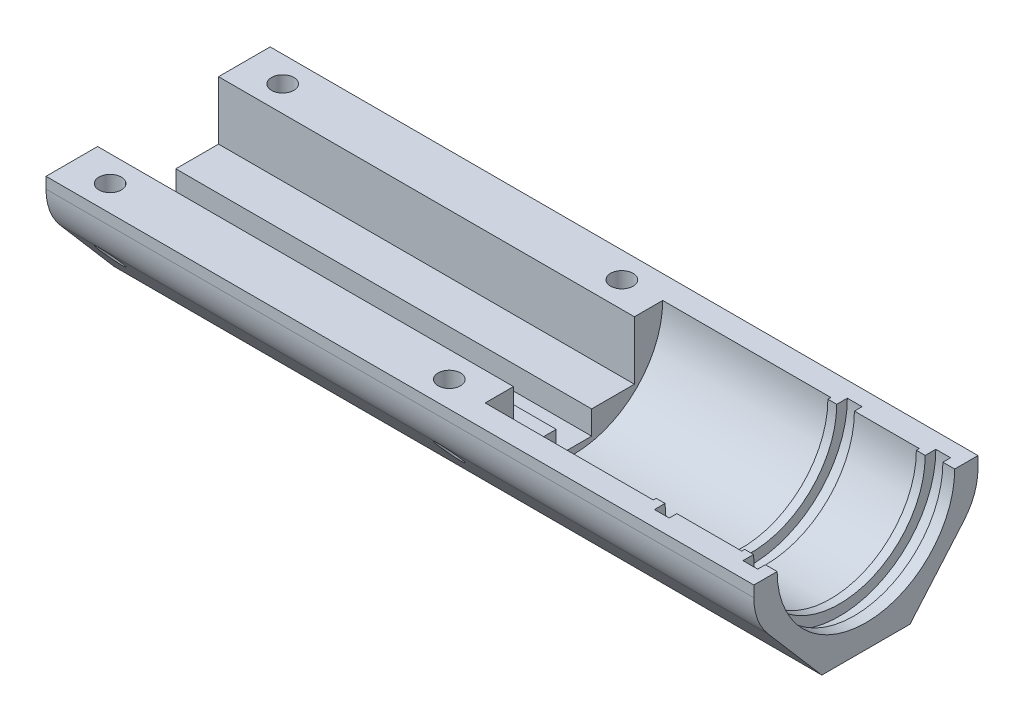
ISO-10303-21;
HEADER;
FILE_DESCRIPTION(('STEP AP214'),'2;1');
FILE_NAME('part.step','',(''),(''),'','','');
FILE_SCHEMA(('AUTOMOTIVE_DESIGN { 1 0 10303 214 1 1 1 1 }'));
ENDSEC;
DATA;
#1=APPLICATION_CONTEXT('core data for automotive mechanical design processes');
#2=APPLICATION_PROTOCOL_DEFINITION('international standard','automotive_design',2000,#1);
#3=PRODUCT_CONTEXT('',#1,'mechanical');
#4=PRODUCT('Part','Part','',(#3));
#5=PRODUCT_RELATED_PRODUCT_CATEGORY('part','',(#4));
#6=PRODUCT_DEFINITION_FORMATION('','',#4);
#7=PRODUCT_DEFINITION_CONTEXT('part definition',#1,'design');
#8=PRODUCT_DEFINITION('design','',#6,#7);
#9=PRODUCT_DEFINITION_SHAPE('','',#8);
#10=(LENGTH_UNIT() NAMED_UNIT(*) SI_UNIT(.MILLI.,.METRE.));
#11=(NAMED_UNIT(*) PLANE_ANGLE_UNIT() SI_UNIT($,.RADIAN.));
#12=(NAMED_UNIT(*) SI_UNIT($,.STERADIAN.) SOLID_ANGLE_UNIT());
#13=UNCERTAINTY_MEASURE_WITH_UNIT(LENGTH_MEASURE(1.E-05),#10,'distance_accuracy_value','');
#14=(GEOMETRIC_REPRESENTATION_CONTEXT(3) GLOBAL_UNCERTAINTY_ASSIGNED_CONTEXT((#13)) GLOBAL_UNIT_ASSIGNED_CONTEXT((#10,
#11,#12)) REPRESENTATION_CONTEXT('',''));
#15=CARTESIAN_POINT('',(0.,0.,0.));
#16=DIRECTION('',(0.,0.,1.));
#17=DIRECTION('',(1.,0.,0.));
#18=AXIS2_PLACEMENT_3D('',#15,#16,#17);
#19=CARTESIAN_POINT('',(0.,0.,-15.05));
#20=DIRECTION('',(-1.,0.,0.));
#21=DIRECTION('',(0.,0.,1.));
#22=AXIS2_PLACEMENT_3D('',#19,#20,#21);
#23=PLANE('',#22);
#24=DIRECTION('',(0.,1.,0.));
#25=VECTOR('',#24,1.);
#26=CARTESIAN_POINT('',(0.,0.,10.25));
#27=LINE('',#26,#25);
#28=CARTESIAN_POINT('',(0.,-9.90000000000001,10.25));
#29=VERTEX_POINT('',#28);
#30=CARTESIAN_POINT('',(0.,0.,10.25));
#31=VERTEX_POINT('',#30);
#32=EDGE_CURVE('E50',#29,#31,#27,.T.);
#33=ORIENTED_EDGE('',*,*,#32,.F.);
#34=DIRECTION('',(0.,0.,1.));
#35=VECTOR('',#34,1.);
#36=CARTESIAN_POINT('',(0.,-9.90000000000001,10.25));
#37=LINE('',#36,#35);
#38=CARTESIAN_POINT('',(0.,-9.89999999999999,3.));
#39=VERTEX_POINT('',#38);
#40=EDGE_CURVE('E390',#39,#29,#37,.T.);
#41=ORIENTED_EDGE('',*,*,#40,.F.);
#42=DIRECTION('',(0.,1.,0.));
#43=VECTOR('',#42,1.);
#44=CARTESIAN_POINT('',(0.,-9.89999999999999,3.));
#45=LINE('',#44,#43);
#46=CARTESIAN_POINT('',(0.,-13.9,3.));
#47=VERTEX_POINT('',#46);
#48=EDGE_CURVE('E387',#47,#39,#45,.T.);
#49=ORIENTED_EDGE('',*,*,#48,.F.);
#50=DIRECTION('',(0.,0.,1.));
#51=VECTOR('',#50,1.);
#52=CARTESIAN_POINT('',(0.,-13.9,-3.));
#53=LINE('',#52,#51);
#54=CARTESIAN_POINT('',(0.,-13.9,-3.));
#55=VERTEX_POINT('',#54);
#56=EDGE_CURVE('E384',#55,#47,#53,.T.);
#57=ORIENTED_EDGE('',*,*,#56,.F.);
#58=DIRECTION('',(0.,-1.,0.));
#59=VECTOR('',#58,1.);
#60=CARTESIAN_POINT('',(0.,-9.9,-2.99999999999999));
#61=LINE('',#60,#59);
#62=CARTESIAN_POINT('',(0.,-9.9,-2.99999999999999));
#63=VERTEX_POINT('',#62);
#64=EDGE_CURVE('E381',#63,#55,#61,.T.);
#65=ORIENTED_EDGE('',*,*,#64,.F.);
#66=DIRECTION('',(0.,0.,1.));
#67=VECTOR('',#66,1.);
#68=CARTESIAN_POINT('',(0.,-9.9,-2.99999999999999));
#69=LINE('',#68,#67);
#70=CARTESIAN_POINT('',(0.,-9.90000000000001,-10.25));
#71=VERTEX_POINT('',#70);
#72=EDGE_CURVE('E252',#71,#63,#69,.T.);
#73=ORIENTED_EDGE('',*,*,#72,.F.);
#74=DIRECTION('',(0.,-1.,0.));
#75=VECTOR('',#74,1.);
#76=CARTESIAN_POINT('',(0.,0.,-10.25));
#77=LINE('',#76,#75);
#78=CARTESIAN_POINT('',(0.,0.,-10.25));
#79=VERTEX_POINT('',#78);
#80=EDGE_CURVE('E236',#79,#71,#77,.T.);
#81=ORIENTED_EDGE('',*,*,#80,.F.);
#82=DIRECTION('',(0.,0.,-1.));
#83=VECTOR('',#82,1.);
#84=CARTESIAN_POINT('',(0.,0.,-15.05));
#85=LINE('',#84,#83);
#86=CARTESIAN_POINT('',(0.,0.,-19.));
#87=VERTEX_POINT('',#86);
#88=EDGE_CURVE('E248',#79,#87,#85,.T.);
#89=ORIENTED_EDGE('',*,*,#88,.T.);
#90=DIRECTION('',(0.,1.,0.));
#91=VECTOR('',#90,1.);
#92=CARTESIAN_POINT('',(0.,0.,-19.));
#93=LINE('',#92,#91);
#94=CARTESIAN_POINT('',(0.,-1.87765266245654,-19.));
#95=VERTEX_POINT('',#94);
#96=EDGE_CURVE('E430',#95,#87,#93,.T.);
#97=ORIENTED_EDGE('',*,*,#96,.F.);
#98=CARTESIAN_POINT('',(0.,-1.87765266245654,-9.));
#99=DIRECTION('',(-1.,0.,0.));
#100=DIRECTION('',(0.,0.,1.));
#101=AXIS2_PLACEMENT_3D('',#98,#99,#100);
#102=CIRCLE('',#101,10.);
#103=CARTESIAN_POINT('',(0.,-8.39458052178645,-16.5848303393214));
#104=VERTEX_POINT('',#103);
#105=EDGE_CURVE('E340',#95,#104,#102,.T.);
#106=ORIENTED_EDGE('',*,*,#105,.T.);
#107=DIRECTION('',(0.,-0.758483033932136,0.651692785932991));
#108=VECTOR('',#107,1.);
#109=CARTESIAN_POINT('',(0.,-4.32387106802505,-20.0824062453935));
#110=LINE('',#109,#108);
#111=CARTESIAN_POINT('',(0.,-19.0000000000001,-7.47259571237857));
#112=VERTEX_POINT('',#111);
#113=EDGE_CURVE('E422',#104,#112,#110,.T.);
#114=ORIENTED_EDGE('',*,*,#113,.T.);
#115=DIRECTION('',(0.,0.,1.));
#116=VECTOR('',#115,1.);
#117=CARTESIAN_POINT('',(0.,-18.9999999999999,25.0500000000001));
#118=LINE('',#117,#116);
#119=CARTESIAN_POINT('',(0.,-19.,7.4725957123786));
#120=VERTEX_POINT('',#119);
#121=EDGE_CURVE('E432',#112,#120,#118,.T.);
#122=ORIENTED_EDGE('',*,*,#121,.T.);
#123=DIRECTION('',(0.,0.758483033932136,0.651692785932991));
#124=VECTOR('',#123,1.);
#125=CARTESIAN_POINT('',(0.,-19.2022385041559,7.2988312795567));
#126=LINE('',#125,#124);
#127=CARTESIAN_POINT('',(0.,-8.39458052178646,16.5848303393214));
#128=VERTEX_POINT('',#127);
#129=EDGE_CURVE('E410',#120,#128,#126,.T.);
#130=ORIENTED_EDGE('',*,*,#129,.T.);
#131=CARTESIAN_POINT('',(0.,-1.87765266245654,9.));
#132=DIRECTION('',(-1.,0.,0.));
#133=DIRECTION('',(0.,0.,1.));
#134=AXIS2_PLACEMENT_3D('',#131,#132,#133);
#135=CIRCLE('',#134,10.);
#136=CARTESIAN_POINT('',(0.,-1.87765266245654,19.));
#137=VERTEX_POINT('',#136);
#138=EDGE_CURVE('E58',#128,#137,#135,.T.);
#139=ORIENTED_EDGE('',*,*,#138,.T.);
#140=DIRECTION('',(0.,-1.,0.));
#141=VECTOR('',#140,1.);
#142=CARTESIAN_POINT('',(0.,0.,19.));
#143=LINE('',#142,#141);
#144=CARTESIAN_POINT('',(0.,0.,19.));
#145=VERTEX_POINT('',#144);
#146=EDGE_CURVE('E417',#145,#137,#143,.T.);
#147=ORIENTED_EDGE('',*,*,#146,.F.);
#148=DIRECTION('',(0.,0.,1.));
#149=VECTOR('',#148,1.);
#150=CARTESIAN_POINT('',(0.,0.,15.05));
#151=LINE('',#150,#149);
#152=EDGE_CURVE('E447',#31,#145,#151,.T.);
#153=ORIENTED_EDGE('',*,*,#152,.F.);
#154=EDGE_LOOP('',(#33,#41,#49,#57,#65,#73,#81,#89,#97,#106,#114,#122,#130,#139,#147,#153));
#155=FACE_BOUND('',#154,.T.);
#156=ADVANCED_FACE('F33',(#155),#23,.T.);
#157=CARTESIAN_POINT('',(120.,0.,-15.05));
#158=DIRECTION('',(1.,0.,0.));
#159=DIRECTION('',(0.,0.,-1.));
#160=AXIS2_PLACEMENT_3D('',#157,#158,#159);
#161=PLANE('',#160);
#162=DIRECTION('',(0.,0.758483033932136,-0.651692785932991));
#163=VECTOR('',#162,1.);
#164=CARTESIAN_POINT('',(120.,-4.32387106802505,-20.0824062453935));
#165=LINE('',#164,#163);
#166=CARTESIAN_POINT('',(120.,-19.0000000000001,-7.47259571237857));
#167=VERTEX_POINT('',#166);
#168=CARTESIAN_POINT('',(120.,-8.39458052178645,-16.5848303393214));
#169=VERTEX_POINT('',#168);
#170=EDGE_CURVE('E419',#167,#169,#165,.T.);
#171=ORIENTED_EDGE('',*,*,#170,.T.);
#172=CARTESIAN_POINT('',(120.,-1.87765266245654,-9.));
#173=DIRECTION('',(1.,0.,0.));
#174=DIRECTION('',(0.,0.,-1.));
#175=AXIS2_PLACEMENT_3D('',#172,#173,#174);
#176=CIRCLE('',#175,10.);
#177=CARTESIAN_POINT('',(120.,-1.87765266245654,-19.));
#178=VERTEX_POINT('',#177);
#179=EDGE_CURVE('E335',#169,#178,#176,.T.);
#180=ORIENTED_EDGE('',*,*,#179,.T.);
#181=DIRECTION('',(0.,-1.,0.));
#182=VECTOR('',#181,1.);
#183=CARTESIAN_POINT('',(120.,0.,-19.));
#184=LINE('',#183,#182);
#185=CARTESIAN_POINT('',(120.,0.,-19.));
#186=VERTEX_POINT('',#185);
#187=EDGE_CURVE('E427',#186,#178,#184,.T.);
#188=ORIENTED_EDGE('',*,*,#187,.F.);
#189=DIRECTION('',(0.,0.,1.));
#190=VECTOR('',#189,1.);
#191=CARTESIAN_POINT('',(120.,0.,-15.05));
#192=LINE('',#191,#190);
#193=CARTESIAN_POINT('',(120.,0.,-15.05));
#194=VERTEX_POINT('',#193);
#195=EDGE_CURVE('E258',#186,#194,#192,.T.);
#196=ORIENTED_EDGE('',*,*,#195,.T.);
#197=CARTESIAN_POINT('',(120.,0.,0.));
#198=DIRECTION('',(-1.,0.,0.));
#199=DIRECTION('',(0.,0.,1.));
#200=AXIS2_PLACEMENT_3D('',#197,#198,#199);
#201=CIRCLE('',#200,15.05);
#202=CARTESIAN_POINT('',(120.,0.,15.05));
#203=VERTEX_POINT('',#202);
#204=EDGE_CURVE('E311',#194,#203,#201,.T.);
#205=ORIENTED_EDGE('',*,*,#204,.T.);
#206=DIRECTION('',(0.,0.,-1.));
#207=VECTOR('',#206,1.);
#208=CARTESIAN_POINT('',(120.,0.,15.05));
#209=LINE('',#208,#207);
#210=CARTESIAN_POINT('',(120.,0.,19.));
#211=VERTEX_POINT('',#210);
#212=EDGE_CURVE('E449',#211,#203,#209,.T.);
#213=ORIENTED_EDGE('',*,*,#212,.F.);
#214=DIRECTION('',(0.,1.,0.));
#215=VECTOR('',#214,1.);
#216=CARTESIAN_POINT('',(120.,0.,19.));
#217=LINE('',#216,#215);
#218=CARTESIAN_POINT('',(120.,-1.87765266245654,19.));
#219=VERTEX_POINT('',#218);
#220=EDGE_CURVE('E415',#219,#211,#217,.T.);
#221=ORIENTED_EDGE('',*,*,#220,.F.);
#222=CARTESIAN_POINT('',(120.,-1.87765266245654,9.));
#223=DIRECTION('',(1.,0.,0.));
#224=DIRECTION('',(0.,0.,-1.));
#225=AXIS2_PLACEMENT_3D('',#222,#223,#224);
#226=CIRCLE('',#225,10.);
#227=CARTESIAN_POINT('',(120.,-8.39458052178645,16.5848303393214));
#228=VERTEX_POINT('',#227);
#229=EDGE_CURVE('E333',#219,#228,#226,.T.);
#230=ORIENTED_EDGE('',*,*,#229,.T.);
#231=DIRECTION('',(0.,-0.758483033932136,-0.651692785932991));
#232=VECTOR('',#231,1.);
#233=CARTESIAN_POINT('',(120.,-19.2022385041559,7.2988312795567));
#234=LINE('',#233,#232);
#235=CARTESIAN_POINT('',(120.,-19.,7.4725957123786));
#236=VERTEX_POINT('',#235);
#237=EDGE_CURVE('E408',#228,#236,#234,.T.);
#238=ORIENTED_EDGE('',*,*,#237,.T.);
#239=DIRECTION('',(0.,0.,1.));
#240=VECTOR('',#239,1.);
#241=CARTESIAN_POINT('',(120.,-19.0000000000001,-15.0499999999999));
#242=LINE('',#241,#240);
#243=EDGE_CURVE('E323',#167,#236,#242,.T.);
#244=ORIENTED_EDGE('',*,*,#243,.F.);
#245=EDGE_LOOP('',(#171,#180,#188,#196,#205,#213,#221,#230,#238,#244));
#246=FACE_BOUND('',#245,.T.);
#247=ADVANCED_FACE('F553',(#246),#161,.T.);
#248=CARTESIAN_POINT('',(0.,-19.,0.));
#249=DIRECTION('',(0.,1.,0.));
#250=DIRECTION('',(0.,0.,1.));
#251=AXIS2_PLACEMENT_3D('',#248,#249,#250);
#252=PLANE('',#251);
#253=DIRECTION('',(1.,0.,0.));
#254=VECTOR('',#253,1.);
#255=CARTESIAN_POINT('',(0.,-19.,7.47259571237864));
#256=LINE('',#255,#254);
#257=EDGE_CURVE('E412',#120,#236,#256,.T.);
#258=ORIENTED_EDGE('',*,*,#257,.F.);
#259=ORIENTED_EDGE('',*,*,#121,.F.);
#260=DIRECTION('',(-1.,0.,0.));
#261=VECTOR('',#260,1.);
#262=CARTESIAN_POINT('',(0.,-19.,-7.4725957123786));
#263=LINE('',#262,#261);
#264=EDGE_CURVE('E424',#167,#112,#263,.T.);
#265=ORIENTED_EDGE('',*,*,#264,.F.);
#266=ORIENTED_EDGE('',*,*,#243,.T.);
#267=EDGE_LOOP('',(#258,#259,#265,#266));
#268=FACE_BOUND('',#267,.T.);
#269=ADVANCED_FACE('F571',(#268),#252,.F.);
#270=CARTESIAN_POINT('',(0.,0.,19.));
#271=DIRECTION('',(0.,0.,-1.));
#272=DIRECTION('',(1.,0.,0.));
#273=AXIS2_PLACEMENT_3D('',#270,#271,#272);
#274=PLANE('',#273);
#275=ORIENTED_EDGE('',*,*,#146,.T.);
#276=DIRECTION('',(-1.,0.,0.));
#277=VECTOR('',#276,1.);
#278=CARTESIAN_POINT('',(120.,-1.87765266245654,19.));
#279=LINE('',#278,#277);
#280=EDGE_CURVE('E345',#137,#219,#279,.F.);
#281=ORIENTED_EDGE('',*,*,#280,.T.);
#282=ORIENTED_EDGE('',*,*,#220,.T.);
#283=DIRECTION('',(-1.,0.,0.));
#284=VECTOR('',#283,1.);
#285=CARTESIAN_POINT('',(0.,0.,19.));
#286=LINE('',#285,#284);
#287=EDGE_CURVE('E327',#211,#145,#286,.T.);
#288=ORIENTED_EDGE('',*,*,#287,.T.);
#289=EDGE_LOOP('',(#275,#281,#282,#288));
#290=FACE_BOUND('',#289,.T.);
#291=ADVANCED_FACE('F580',(#290),#274,.F.);
#292=CARTESIAN_POINT('',(0.,0.,-19.));
#293=DIRECTION('',(0.,0.,1.));
#294=DIRECTION('',(1.,0.,0.));
#295=AXIS2_PLACEMENT_3D('',#292,#293,#294);
#296=PLANE('',#295);
#297=ORIENTED_EDGE('',*,*,#187,.T.);
#298=DIRECTION('',(1.,0.,0.));
#299=VECTOR('',#298,1.);
#300=CARTESIAN_POINT('',(0.,-1.87765266245654,-19.));
#301=LINE('',#300,#299);
#302=EDGE_CURVE('E337',#178,#95,#301,.F.);
#303=ORIENTED_EDGE('',*,*,#302,.T.);
#304=ORIENTED_EDGE('',*,*,#96,.T.);
#305=DIRECTION('',(-1.,0.,0.));
#306=VECTOR('',#305,1.);
#307=CARTESIAN_POINT('',(0.,0.,-19.));
#308=LINE('',#307,#306);
#309=EDGE_CURVE('E257',#186,#87,#308,.T.);
#310=ORIENTED_EDGE('',*,*,#309,.F.);
#311=EDGE_LOOP('',(#297,#303,#304,#310));
#312=FACE_BOUND('',#311,.T.);
#313=ADVANCED_FACE('F558',(#312),#296,.F.);
#314=CARTESIAN_POINT('',(0.,0.,0.));
#315=DIRECTION('',(-1.,0.,0.));
#316=DIRECTION('',(0.,0.,1.));
#317=AXIS2_PLACEMENT_3D('',#314,#315,#316);
#318=CYLINDRICAL_SURFACE('',#317,14.55);
#319=CARTESIAN_POINT('',(99.,0.,0.));
#320=DIRECTION('',(-1.,0.,0.));
#321=DIRECTION('',(0.,0.,1.));
#322=AXIS2_PLACEMENT_3D('',#319,#320,#321);
#323=CIRCLE('',#322,14.55);
#324=CARTESIAN_POINT('',(99.,0.,-14.55));
#325=VERTEX_POINT('',#324);
#326=CARTESIAN_POINT('',(99.,0.,14.55));
#327=VERTEX_POINT('',#326);
#328=EDGE_CURVE('E318',#325,#327,#323,.T.);
#329=ORIENTED_EDGE('',*,*,#328,.T.);
#330=DIRECTION('',(-1.,0.,0.));
#331=VECTOR('',#330,1.);
#332=CARTESIAN_POINT('',(100.5,0.,14.55));
#333=LINE('',#332,#331);
#334=CARTESIAN_POINT('',(100.5,0.,14.55));
#335=VERTEX_POINT('',#334);
#336=EDGE_CURVE('E435',#335,#327,#333,.T.);
#337=ORIENTED_EDGE('',*,*,#336,.F.);
#338=CARTESIAN_POINT('',(100.5,0.,0.));
#339=DIRECTION('',(-1.,0.,0.));
#340=DIRECTION('',(0.,0.,1.));
#341=AXIS2_PLACEMENT_3D('',#338,#339,#340);
#342=CIRCLE('',#341,14.55);
#343=CARTESIAN_POINT('',(100.5,0.,-14.55));
#344=VERTEX_POINT('',#343);
#345=EDGE_CURVE('E320',#344,#335,#342,.T.);
#346=ORIENTED_EDGE('',*,*,#345,.F.);
#347=DIRECTION('',(-1.,0.,0.));
#348=VECTOR('',#347,1.);
#349=CARTESIAN_POINT('',(100.5,0.,-14.55));
#350=LINE('',#349,#348);
#351=EDGE_CURVE('E482',#344,#325,#350,.T.);
#352=ORIENTED_EDGE('',*,*,#351,.T.);
#353=EDGE_LOOP('',(#329,#337,#346,#352));
#354=FACE_BOUND('',#353,.T.);
#355=ADVANCED_FACE('F510',(#354),#318,.F.);
#356=CARTESIAN_POINT('',(99.,0.,-15.05));
#357=DIRECTION('',(-1.,0.,0.));
#358=DIRECTION('',(0.,0.,1.));
#359=AXIS2_PLACEMENT_3D('',#356,#357,#358);
#360=PLANE('',#359);
#361=CARTESIAN_POINT('',(99.,0.,0.));
#362=DIRECTION('',(-1.,0.,0.));
#363=DIRECTION('',(0.,0.,1.));
#364=AXIS2_PLACEMENT_3D('',#361,#362,#363);
#365=CIRCLE('',#364,15.05);
#366=CARTESIAN_POINT('',(99.,0.,-15.05));
#367=VERTEX_POINT('',#366);
#368=CARTESIAN_POINT('',(99.,0.,15.05));
#369=VERTEX_POINT('',#368);
#370=EDGE_CURVE('E316',#367,#369,#365,.T.);
#371=ORIENTED_EDGE('',*,*,#370,.T.);
#372=DIRECTION('',(0.,0.,1.));
#373=VECTOR('',#372,1.);
#374=CARTESIAN_POINT('',(99.,0.,15.05));
#375=LINE('',#374,#373);
#376=EDGE_CURVE('E438',#327,#369,#375,.T.);
#377=ORIENTED_EDGE('',*,*,#376,.F.);
#378=ORIENTED_EDGE('',*,*,#328,.F.);
#379=DIRECTION('',(0.,0.,-1.));
#380=VECTOR('',#379,1.);
#381=CARTESIAN_POINT('',(99.,0.,-15.05));
#382=LINE('',#381,#380);
#383=EDGE_CURVE('E485',#325,#367,#382,.T.);
#384=ORIENTED_EDGE('',*,*,#383,.T.);
#385=EDGE_LOOP('',(#371,#377,#378,#384));
#386=FACE_BOUND('',#385,.T.);
#387=ADVANCED_FACE('F505',(#386),#360,.T.);
#388=CARTESIAN_POINT('',(0.,0.,0.));
#389=DIRECTION('',(-1.,0.,0.));
#390=DIRECTION('',(0.,0.,1.));
#391=AXIS2_PLACEMENT_3D('',#388,#389,#390);
#392=CYLINDRICAL_SURFACE('',#391,15.05);
#393=CARTESIAN_POINT('',(70.5,0.,0.));
#394=DIRECTION('',(-1.,0.,0.));
#395=DIRECTION('',(0.,0.,1.));
#396=AXIS2_PLACEMENT_3D('',#393,#394,#395);
#397=CIRCLE('',#396,15.05);
#398=CARTESIAN_POINT('',(70.5,0.,-15.05));
#399=VERTEX_POINT('',#398);
#400=CARTESIAN_POINT('',(70.5,0.,15.05));
#401=VERTEX_POINT('',#400);
#402=EDGE_CURVE('E314',#399,#401,#397,.T.);
#403=ORIENTED_EDGE('',*,*,#402,.T.);
#404=DIRECTION('',(-1.,0.,0.));
#405=VECTOR('',#404,1.);
#406=CARTESIAN_POINT('',(70.5,0.,15.05));
#407=LINE('',#406,#405);
#408=EDGE_CURVE('E441',#369,#401,#407,.T.);
#409=ORIENTED_EDGE('',*,*,#408,.F.);
#410=ORIENTED_EDGE('',*,*,#370,.F.);
#411=DIRECTION('',(-1.,0.,0.));
#412=VECTOR('',#411,1.);
#413=CARTESIAN_POINT('',(70.5,0.,-15.05));
#414=LINE('',#413,#412);
#415=EDGE_CURVE('E263',#367,#399,#414,.T.);
#416=ORIENTED_EDGE('',*,*,#415,.T.);
#417=EDGE_LOOP('',(#403,#409,#410,#416));
#418=FACE_BOUND('',#417,.T.);
#419=ADVANCED_FACE('F490',(#418),#392,.F.);
#420=CARTESIAN_POINT('',(70.5,0.,-15.05));
#421=DIRECTION('',(1.,0.,0.));
#422=DIRECTION('',(0.,0.,-1.));
#423=AXIS2_PLACEMENT_3D('',#420,#421,#422);
#424=PLANE('',#423);
#425=DIRECTION('',(0.,-1.,0.));
#426=VECTOR('',#425,1.);
#427=CARTESIAN_POINT('',(70.5,0.,10.25));
#428=LINE('',#427,#426);
#429=CARTESIAN_POINT('',(70.5,0.,10.25));
#430=VERTEX_POINT('',#429);
#431=CARTESIAN_POINT('',(70.5,-9.90000000000001,10.25));
#432=VERTEX_POINT('',#431);
#433=EDGE_CURVE('E396',#430,#432,#428,.T.);
#434=ORIENTED_EDGE('',*,*,#433,.F.);
#435=DIRECTION('',(0.,0.,-1.));
#436=VECTOR('',#435,1.);
#437=CARTESIAN_POINT('',(70.5,0.,15.05));
#438=LINE('',#437,#436);
#439=EDGE_CURVE('E444',#401,#430,#438,.T.);
#440=ORIENTED_EDGE('',*,*,#439,.F.);
#441=ORIENTED_EDGE('',*,*,#402,.F.);
#442=DIRECTION('',(0.,0.,1.));
#443=VECTOR('',#442,1.);
#444=CARTESIAN_POINT('',(70.5,0.,-15.05));
#445=LINE('',#444,#443);
#446=CARTESIAN_POINT('',(70.5,0.,-10.25));
#447=VERTEX_POINT('',#446);
#448=EDGE_CURVE('E259',#399,#447,#445,.T.);
#449=ORIENTED_EDGE('',*,*,#448,.T.);
#450=DIRECTION('',(0.,1.,0.));
#451=VECTOR('',#450,1.);
#452=CARTESIAN_POINT('',(70.5,0.,-10.25));
#453=LINE('',#452,#451);
#454=CARTESIAN_POINT('',(70.5,-9.90000000000001,-10.25));
#455=VERTEX_POINT('',#454);
#456=EDGE_CURVE('E239',#455,#447,#453,.T.);
#457=ORIENTED_EDGE('',*,*,#456,.F.);
#458=DIRECTION('',(0.,0.,-1.));
#459=VECTOR('',#458,1.);
#460=CARTESIAN_POINT('',(70.5,-9.90000000000001,-15.05));
#461=LINE('',#460,#459);
#462=CARTESIAN_POINT('',(70.5,-9.9,-2.99999999999999));
#463=VERTEX_POINT('',#462);
#464=EDGE_CURVE('E244',#463,#455,#461,.T.);
#465=ORIENTED_EDGE('',*,*,#464,.F.);
#466=DIRECTION('',(0.,1.,0.));
#467=VECTOR('',#466,1.);
#468=CARTESIAN_POINT('',(70.5,0.,-2.99999999999996));
#469=LINE('',#468,#467);
#470=CARTESIAN_POINT('',(70.5,-13.9,-3.));
#471=VERTEX_POINT('',#470);
#472=EDGE_CURVE('E349',#471,#463,#469,.T.);
#473=ORIENTED_EDGE('',*,*,#472,.F.);
#474=DIRECTION('',(0.,0.,-1.));
#475=VECTOR('',#474,1.);
#476=CARTESIAN_POINT('',(70.5,-13.9,-15.05));
#477=LINE('',#476,#475);
#478=CARTESIAN_POINT('',(70.5,-13.9,3.));
#479=VERTEX_POINT('',#478);
#480=EDGE_CURVE('E351',#479,#471,#477,.T.);
#481=ORIENTED_EDGE('',*,*,#480,.F.);
#482=DIRECTION('',(0.,-1.,0.));
#483=VECTOR('',#482,1.);
#484=CARTESIAN_POINT('',(70.5,0.,3.));
#485=LINE('',#484,#483);
#486=CARTESIAN_POINT('',(70.5,-9.89999999999999,3.));
#487=VERTEX_POINT('',#486);
#488=EDGE_CURVE('E42',#487,#479,#485,.T.);
#489=ORIENTED_EDGE('',*,*,#488,.F.);
#490=DIRECTION('',(0.,0.,-1.));
#491=VECTOR('',#490,1.);
#492=CARTESIAN_POINT('',(70.5,-9.89999999999994,-15.05));
#493=LINE('',#492,#491);
#494=EDGE_CURVE('E11',#432,#487,#493,.T.);
#495=ORIENTED_EDGE('',*,*,#494,.F.);
#496=EDGE_LOOP('',(#434,#440,#441,#449,#457,#465,#473,#481,#489,#495));
#497=FACE_BOUND('',#496,.T.);
#498=ADVANCED_FACE('F495',(#497),#424,.T.);
#499=CARTESIAN_POINT('',(0.,0.,0.));
#500=DIRECTION('',(-1.,0.,0.));
#501=DIRECTION('',(0.,0.,1.));
#502=AXIS2_PLACEMENT_3D('',#499,#500,#501);
#503=CYLINDRICAL_SURFACE('',#502,15.05);
#504=CARTESIAN_POINT('',(118.,0.,0.));
#505=DIRECTION('',(-1.,0.,0.));
#506=DIRECTION('',(0.,0.,1.));
#507=AXIS2_PLACEMENT_3D('',#504,#505,#506);
#508=CIRCLE('',#507,15.05);
#509=CARTESIAN_POINT('',(118.,0.,-15.05));
#510=VERTEX_POINT('',#509);
#511=CARTESIAN_POINT('',(118.,0.,15.05));
#512=VERTEX_POINT('',#511);
#513=EDGE_CURVE('E309',#510,#512,#508,.T.);
#514=ORIENTED_EDGE('',*,*,#513,.T.);
#515=DIRECTION('',(-1.,0.,0.));
#516=VECTOR('',#515,1.);
#517=CARTESIAN_POINT('',(118.,0.,15.05));
#518=LINE('',#517,#516);
#519=EDGE_CURVE('E451',#203,#512,#518,.T.);
#520=ORIENTED_EDGE('',*,*,#519,.F.);
#521=ORIENTED_EDGE('',*,*,#204,.F.);
#522=DIRECTION('',(-1.,0.,0.));
#523=VECTOR('',#522,1.);
#524=CARTESIAN_POINT('',(118.,0.,-15.05));
#525=LINE('',#524,#523);
#526=EDGE_CURVE('E261',#194,#510,#525,.T.);
#527=ORIENTED_EDGE('',*,*,#526,.T.);
#528=EDGE_LOOP('',(#514,#520,#521,#527));
#529=FACE_BOUND('',#528,.T.);
#530=ADVANCED_FACE('F550',(#529),#503,.F.);
#531=CARTESIAN_POINT('',(118.,0.,-15.05));
#532=DIRECTION('',(-1.,0.,0.));
#533=DIRECTION('',(0.,0.,1.));
#534=AXIS2_PLACEMENT_3D('',#531,#532,#533);
#535=PLANE('',#534);
#536=CARTESIAN_POINT('',(118.,0.,0.));
#537=DIRECTION('',(-1.,0.,0.));
#538=DIRECTION('',(0.,0.,1.));
#539=AXIS2_PLACEMENT_3D('',#536,#537,#538);
#540=CIRCLE('',#539,16.35);
#541=CARTESIAN_POINT('',(118.,0.,-16.35));
#542=VERTEX_POINT('',#541);
#543=CARTESIAN_POINT('',(118.,0.,16.35));
#544=VERTEX_POINT('',#543);
#545=EDGE_CURVE('E307',#542,#544,#540,.T.);
#546=ORIENTED_EDGE('',*,*,#545,.T.);
#547=DIRECTION('',(0.,0.,1.));
#548=VECTOR('',#547,1.);
#549=CARTESIAN_POINT('',(118.,0.,15.05));
#550=LINE('',#549,#548);
#551=EDGE_CURVE('E454',#512,#544,#550,.T.);
#552=ORIENTED_EDGE('',*,*,#551,.F.);
#553=ORIENTED_EDGE('',*,*,#513,.F.);
#554=DIRECTION('',(0.,0.,-1.));
#555=VECTOR('',#554,1.);
#556=CARTESIAN_POINT('',(118.,0.,-15.05));
#557=LINE('',#556,#555);
#558=EDGE_CURVE('E269',#510,#542,#557,.T.);
#559=ORIENTED_EDGE('',*,*,#558,.T.);
#560=EDGE_LOOP('',(#546,#552,#553,#559));
#561=FACE_BOUND('',#560,.T.);
#562=ADVANCED_FACE('F545',(#561),#535,.T.);
#563=CARTESIAN_POINT('',(0.,0.,0.));
#564=DIRECTION('',(-1.,0.,0.));
#565=DIRECTION('',(0.,0.,1.));
#566=AXIS2_PLACEMENT_3D('',#563,#564,#565);
#567=CYLINDRICAL_SURFACE('',#566,16.35);
#568=CARTESIAN_POINT('',(115.5,0.,0.));
#569=DIRECTION('',(-1.,0.,0.));
#570=DIRECTION('',(0.,0.,1.));
#571=AXIS2_PLACEMENT_3D('',#568,#569,#570);
#572=CIRCLE('',#571,16.35);
#573=CARTESIAN_POINT('',(115.5,0.,-16.35));
#574=VERTEX_POINT('',#573);
#575=CARTESIAN_POINT('',(115.5,0.,16.35));
#576=VERTEX_POINT('',#575);
#577=EDGE_CURVE('E305',#574,#576,#572,.T.);
#578=ORIENTED_EDGE('',*,*,#577,.T.);
#579=DIRECTION('',(-1.,0.,0.));
#580=VECTOR('',#579,1.);
#581=CARTESIAN_POINT('',(115.5,0.,16.35));
#582=LINE('',#581,#580);
#583=EDGE_CURVE('E457',#544,#576,#582,.T.);
#584=ORIENTED_EDGE('',*,*,#583,.F.);
#585=ORIENTED_EDGE('',*,*,#545,.F.);
#586=DIRECTION('',(-1.,0.,0.));
#587=VECTOR('',#586,1.);
#588=CARTESIAN_POINT('',(115.5,0.,-16.35));
#589=LINE('',#588,#587);
#590=EDGE_CURVE('E272',#542,#574,#589,.T.);
#591=ORIENTED_EDGE('',*,*,#590,.T.);
#592=EDGE_LOOP('',(#578,#584,#585,#591));
#593=FACE_BOUND('',#592,.T.);
#594=ADVANCED_FACE('F541',(#593),#567,.F.);
#595=CARTESIAN_POINT('',(115.5,0.,-15.05));
#596=DIRECTION('',(1.,0.,0.));
#597=DIRECTION('',(0.,0.,-1.));
#598=AXIS2_PLACEMENT_3D('',#595,#596,#597);
#599=PLANE('',#598);
#600=CARTESIAN_POINT('',(115.5,0.,0.));
#601=DIRECTION('',(-1.,0.,0.));
#602=DIRECTION('',(0.,0.,1.));
#603=AXIS2_PLACEMENT_3D('',#600,#601,#602);
#604=CIRCLE('',#603,14.55);
#605=CARTESIAN_POINT('',(115.5,0.,-14.55));
#606=VERTEX_POINT('',#605);
#607=CARTESIAN_POINT('',(115.5,0.,14.55));
#608=VERTEX_POINT('',#607);
#609=EDGE_CURVE('E302',#606,#608,#604,.T.);
#610=ORIENTED_EDGE('',*,*,#609,.T.);
#611=DIRECTION('',(0.,0.,-1.));
#612=VECTOR('',#611,1.);
#613=CARTESIAN_POINT('',(115.5,0.,15.05));
#614=LINE('',#613,#612);
#615=EDGE_CURVE('E460',#576,#608,#614,.T.);
#616=ORIENTED_EDGE('',*,*,#615,.F.);
#617=ORIENTED_EDGE('',*,*,#577,.F.);
#618=DIRECTION('',(0.,0.,1.));
#619=VECTOR('',#618,1.);
#620=CARTESIAN_POINT('',(115.5,0.,-15.05));
#621=LINE('',#620,#619);
#622=EDGE_CURVE('E275',#574,#606,#621,.T.);
#623=ORIENTED_EDGE('',*,*,#622,.T.);
#624=EDGE_LOOP('',(#610,#616,#617,#623));
#625=FACE_BOUND('',#624,.T.);
#626=ADVANCED_FACE('F538',(#625),#599,.T.);
#627=CARTESIAN_POINT('',(0.,0.,0.));
#628=DIRECTION('',(-1.,0.,0.));
#629=DIRECTION('',(0.,0.,1.));
#630=AXIS2_PLACEMENT_3D('',#627,#628,#629);
#631=CYLINDRICAL_SURFACE('',#630,14.55);
#632=CARTESIAN_POINT('',(114.,0.,0.));
#633=DIRECTION('',(-1.,0.,0.));
#634=DIRECTION('',(0.,0.,1.));
#635=AXIS2_PLACEMENT_3D('',#632,#633,#634);
#636=CIRCLE('',#635,14.55);
#637=CARTESIAN_POINT('',(114.,0.,-14.55));
#638=VERTEX_POINT('',#637);
#639=CARTESIAN_POINT('',(114.,0.,14.55));
#640=VERTEX_POINT('',#639);
#641=EDGE_CURVE('E300',#638,#640,#636,.T.);
#642=ORIENTED_EDGE('',*,*,#641,.T.);
#643=DIRECTION('',(-1.,0.,0.));
#644=VECTOR('',#643,1.);
#645=CARTESIAN_POINT('',(115.5,0.,14.55));
#646=LINE('',#645,#644);
#647=EDGE_CURVE('E462',#608,#640,#646,.T.);
#648=ORIENTED_EDGE('',*,*,#647,.F.);
#649=ORIENTED_EDGE('',*,*,#609,.F.);
#650=DIRECTION('',(-1.,0.,0.));
#651=VECTOR('',#650,1.);
#652=CARTESIAN_POINT('',(115.5,0.,-14.55));
#653=LINE('',#652,#651);
#654=EDGE_CURVE('E277',#606,#638,#653,.T.);
#655=ORIENTED_EDGE('',*,*,#654,.T.);
#656=EDGE_LOOP('',(#642,#648,#649,#655));
#657=FACE_BOUND('',#656,.T.);
#658=ADVANCED_FACE('F534',(#657),#631,.F.);
#659=CARTESIAN_POINT('',(114.,0.,-15.05));
#660=DIRECTION('',(-1.,0.,0.));
#661=DIRECTION('',(0.,0.,1.));
#662=AXIS2_PLACEMENT_3D('',#659,#660,#661);
#663=PLANE('',#662);
#664=CARTESIAN_POINT('',(114.,0.,0.));
#665=DIRECTION('',(-1.,0.,0.));
#666=DIRECTION('',(0.,0.,1.));
#667=AXIS2_PLACEMENT_3D('',#664,#665,#666);
#668=CIRCLE('',#667,15.05);
#669=CARTESIAN_POINT('',(114.,0.,-15.05));
#670=VERTEX_POINT('',#669);
#671=CARTESIAN_POINT('',(114.,0.,15.05));
#672=VERTEX_POINT('',#671);
#673=EDGE_CURVE('E298',#670,#672,#668,.T.);
#674=ORIENTED_EDGE('',*,*,#673,.T.);
#675=DIRECTION('',(0.,0.,1.));
#676=VECTOR('',#675,1.);
#677=CARTESIAN_POINT('',(114.,0.,15.05));
#678=LINE('',#677,#676);
#679=EDGE_CURVE('E465',#640,#672,#678,.T.);
#680=ORIENTED_EDGE('',*,*,#679,.F.);
#681=ORIENTED_EDGE('',*,*,#641,.F.);
#682=DIRECTION('',(0.,0.,-1.));
#683=VECTOR('',#682,1.);
#684=CARTESIAN_POINT('',(114.,0.,-15.05));
#685=LINE('',#684,#683);
#686=EDGE_CURVE('E280',#638,#670,#685,.T.);
#687=ORIENTED_EDGE('',*,*,#686,.T.);
#688=EDGE_LOOP('',(#674,#680,#681,#687));
#689=FACE_BOUND('',#688,.T.);
#690=ADVANCED_FACE('F528',(#689),#663,.T.);
#691=CARTESIAN_POINT('',(0.,0.,0.));
#692=DIRECTION('',(-1.,0.,0.));
#693=DIRECTION('',(0.,0.,1.));
#694=AXIS2_PLACEMENT_3D('',#691,#692,#693);
#695=CYLINDRICAL_SURFACE('',#694,15.05);
#696=CARTESIAN_POINT('',(103.,0.,0.));
#697=DIRECTION('',(-1.,0.,0.));
#698=DIRECTION('',(0.,0.,1.));
#699=AXIS2_PLACEMENT_3D('',#696,#697,#698);
#700=CIRCLE('',#699,15.05);
#701=CARTESIAN_POINT('',(103.,0.,-15.05));
#702=VERTEX_POINT('',#701);
#703=CARTESIAN_POINT('',(103.,0.,15.05));
#704=VERTEX_POINT('',#703);
#705=EDGE_CURVE('E296',#702,#704,#700,.T.);
#706=ORIENTED_EDGE('',*,*,#705,.T.);
#707=DIRECTION('',(-1.,0.,0.));
#708=VECTOR('',#707,1.);
#709=CARTESIAN_POINT('',(103.,0.,15.05));
#710=LINE('',#709,#708);
#711=EDGE_CURVE('E468',#672,#704,#710,.T.);
#712=ORIENTED_EDGE('',*,*,#711,.F.);
#713=ORIENTED_EDGE('',*,*,#673,.F.);
#714=DIRECTION('',(-1.,0.,0.));
#715=VECTOR('',#714,1.);
#716=CARTESIAN_POINT('',(103.,0.,-15.05));
#717=LINE('',#716,#715);
#718=EDGE_CURVE('E283',#670,#702,#717,.T.);
#719=ORIENTED_EDGE('',*,*,#718,.T.);
#720=EDGE_LOOP('',(#706,#712,#713,#719));
#721=FACE_BOUND('',#720,.T.);
#722=ADVANCED_FACE('F525',(#721),#695,.F.);
#723=CARTESIAN_POINT('',(103.,0.,-15.05));
#724=DIRECTION('',(-1.,0.,0.));
#725=DIRECTION('',(0.,0.,1.));
#726=AXIS2_PLACEMENT_3D('',#723,#724,#725);
#727=PLANE('',#726);
#728=CARTESIAN_POINT('',(103.,0.,0.));
#729=DIRECTION('',(-1.,0.,0.));
#730=DIRECTION('',(0.,0.,1.));
#731=AXIS2_PLACEMENT_3D('',#728,#729,#730);
#732=CIRCLE('',#731,16.35);
#733=CARTESIAN_POINT('',(103.,0.,-16.35));
#734=VERTEX_POINT('',#733);
#735=CARTESIAN_POINT('',(103.,0.,16.35));
#736=VERTEX_POINT('',#735);
#737=EDGE_CURVE('E294',#734,#736,#732,.T.);
#738=ORIENTED_EDGE('',*,*,#737,.T.);
#739=DIRECTION('',(0.,0.,1.));
#740=VECTOR('',#739,1.);
#741=CARTESIAN_POINT('',(103.,0.,15.05));
#742=LINE('',#741,#740);
#743=EDGE_CURVE('E471',#704,#736,#742,.T.);
#744=ORIENTED_EDGE('',*,*,#743,.F.);
#745=ORIENTED_EDGE('',*,*,#705,.F.);
#746=DIRECTION('',(0.,0.,-1.));
#747=VECTOR('',#746,1.);
#748=CARTESIAN_POINT('',(103.,0.,-15.05));
#749=LINE('',#748,#747);
#750=EDGE_CURVE('E286',#702,#734,#749,.T.);
#751=ORIENTED_EDGE('',*,*,#750,.T.);
#752=EDGE_LOOP('',(#738,#744,#745,#751));
#753=FACE_BOUND('',#752,.T.);
#754=ADVANCED_FACE('F521',(#753),#727,.T.);
#755=CARTESIAN_POINT('',(0.,0.,0.));
#756=DIRECTION('',(-1.,0.,0.));
#757=DIRECTION('',(0.,0.,1.));
#758=AXIS2_PLACEMENT_3D('',#755,#756,#757);
#759=CYLINDRICAL_SURFACE('',#758,16.35);
#760=CARTESIAN_POINT('',(100.5,0.,0.));
#761=DIRECTION('',(-1.,0.,0.));
#762=DIRECTION('',(0.,0.,1.));
#763=AXIS2_PLACEMENT_3D('',#760,#761,#762);
#764=CIRCLE('',#763,16.35);
#765=CARTESIAN_POINT('',(100.5,0.,-16.35));
#766=VERTEX_POINT('',#765);
#767=CARTESIAN_POINT('',(100.5,0.,16.35));
#768=VERTEX_POINT('',#767);
#769=EDGE_CURVE('E292',#766,#768,#764,.T.);
#770=ORIENTED_EDGE('',*,*,#769,.T.);
#771=DIRECTION('',(-1.,0.,0.));
#772=VECTOR('',#771,1.);
#773=CARTESIAN_POINT('',(100.5,0.,16.35));
#774=LINE('',#773,#772);
#775=EDGE_CURVE('E474',#736,#768,#774,.T.);
#776=ORIENTED_EDGE('',*,*,#775,.F.);
#777=ORIENTED_EDGE('',*,*,#737,.F.);
#778=DIRECTION('',(-1.,0.,0.));
#779=VECTOR('',#778,1.);
#780=CARTESIAN_POINT('',(100.5,0.,-16.35));
#781=LINE('',#780,#779);
#782=EDGE_CURVE('E289',#734,#766,#781,.T.);
#783=ORIENTED_EDGE('',*,*,#782,.T.);
#784=EDGE_LOOP('',(#770,#776,#777,#783));
#785=FACE_BOUND('',#784,.T.);
#786=ADVANCED_FACE('F516',(#785),#759,.F.);
#787=CARTESIAN_POINT('',(100.5,0.,-15.05));
#788=DIRECTION('',(1.,0.,0.));
#789=DIRECTION('',(0.,0.,-1.));
#790=AXIS2_PLACEMENT_3D('',#787,#788,#789);
#791=PLANE('',#790);
#792=ORIENTED_EDGE('',*,*,#769,.F.);
#793=DIRECTION('',(0.,0.,1.));
#794=VECTOR('',#793,1.);
#795=CARTESIAN_POINT('',(100.5,0.,-15.05));
#796=LINE('',#795,#794);
#797=EDGE_CURVE('E479',#766,#344,#796,.T.);
#798=ORIENTED_EDGE('',*,*,#797,.T.);
#799=ORIENTED_EDGE('',*,*,#345,.T.);
#800=DIRECTION('',(0.,0.,-1.));
#801=VECTOR('',#800,1.);
#802=CARTESIAN_POINT('',(100.5,0.,15.05));
#803=LINE('',#802,#801);
#804=EDGE_CURVE('E477',#768,#335,#803,.T.);
#805=ORIENTED_EDGE('',*,*,#804,.F.);
#806=EDGE_LOOP('',(#792,#798,#799,#805));
#807=FACE_BOUND('',#806,.T.);
#808=ADVANCED_FACE('F513',(#807),#791,.T.);
#809=CARTESIAN_POINT('',(0.,0.,0.));
#810=DIRECTION('',(0.,-1.,0.));
#811=DIRECTION('',(1.,0.,0.));
#812=AXIS2_PLACEMENT_3D('',#809,#810,#811);
#813=PLANE('',#812);
#814=CARTESIAN_POINT('',(6.5,0.,-14.625));
#815=DIRECTION('',(0.,1.,0.));
#816=DIRECTION('',(0.,0.,1.));
#817=AXIS2_PLACEMENT_3D('',#814,#815,#816);
#818=CIRCLE('',#817,1.9);
#819=CARTESIAN_POINT('',(6.5,0.,-12.725));
#820=VERTEX_POINT('',#819);
#821=EDGE_CURVE('E358',#820,#820,#818,.T.);
#822=ORIENTED_EDGE('',*,*,#821,.F.);
#823=EDGE_LOOP('',(#822));
#824=FACE_BOUND('',#823,.T.);
#825=CARTESIAN_POINT('',(64.,0.,-14.625));
#826=DIRECTION('',(0.,1.,0.));
#827=DIRECTION('',(0.,0.,1.));
#828=AXIS2_PLACEMENT_3D('',#825,#826,#827);
#829=CIRCLE('',#828,1.9);
#830=CARTESIAN_POINT('',(64.,0.,-12.725));
#831=VERTEX_POINT('',#830);
#832=EDGE_CURVE('E366',#831,#831,#829,.T.);
#833=ORIENTED_EDGE('',*,*,#832,.F.);
#834=EDGE_LOOP('',(#833));
#835=FACE_BOUND('',#834,.T.);
#836=ORIENTED_EDGE('',*,*,#88,.F.);
#837=DIRECTION('',(1.,0.,0.));
#838=VECTOR('',#837,1.);
#839=CARTESIAN_POINT('',(0.,0.,-10.25));
#840=LINE('',#839,#838);
#841=EDGE_CURVE('E232',#79,#447,#840,.T.);
#842=ORIENTED_EDGE('',*,*,#841,.T.);
#843=ORIENTED_EDGE('',*,*,#448,.F.);
#844=ORIENTED_EDGE('',*,*,#415,.F.);
#845=ORIENTED_EDGE('',*,*,#383,.F.);
#846=ORIENTED_EDGE('',*,*,#351,.F.);
#847=ORIENTED_EDGE('',*,*,#797,.F.);
#848=ORIENTED_EDGE('',*,*,#782,.F.);
#849=ORIENTED_EDGE('',*,*,#750,.F.);
#850=ORIENTED_EDGE('',*,*,#718,.F.);
#851=ORIENTED_EDGE('',*,*,#686,.F.);
#852=ORIENTED_EDGE('',*,*,#654,.F.);
#853=ORIENTED_EDGE('',*,*,#622,.F.);
#854=ORIENTED_EDGE('',*,*,#590,.F.);
#855=ORIENTED_EDGE('',*,*,#558,.F.);
#856=ORIENTED_EDGE('',*,*,#526,.F.);
#857=ORIENTED_EDGE('',*,*,#195,.F.);
#858=ORIENTED_EDGE('',*,*,#309,.T.);
#859=EDGE_LOOP('',(#836,#842,#843,#844,#845,#846,#847,#848,#849,#850,#851,#852,#853,#854,#855,
#856,#857,#858));
#860=FACE_BOUND('',#859,.T.);
#861=ADVANCED_FACE('F255',(#824,#835,#860),#813,.F.);
#862=CARTESIAN_POINT('',(0.,0.,0.));
#863=DIRECTION('',(0.,1.,0.));
#864=DIRECTION('',(1.,0.,0.));
#865=AXIS2_PLACEMENT_3D('',#862,#863,#864);
#866=PLANE('',#865);
#867=CARTESIAN_POINT('',(6.5,0.,14.625));
#868=DIRECTION('',(0.,-1.,0.));
#869=DIRECTION('',(0.,0.,-1.));
#870=AXIS2_PLACEMENT_3D('',#867,#868,#869);
#871=CIRCLE('',#870,1.9);
#872=CARTESIAN_POINT('',(6.5,0.,12.725));
#873=VERTEX_POINT('',#872);
#874=EDGE_CURVE('E362',#873,#873,#871,.T.);
#875=ORIENTED_EDGE('',*,*,#874,.T.);
#876=EDGE_LOOP('',(#875));
#877=FACE_BOUND('',#876,.T.);
#878=CARTESIAN_POINT('',(64.,0.,14.625));
#879=DIRECTION('',(0.,-1.,0.));
#880=DIRECTION('',(0.,0.,-1.));
#881=AXIS2_PLACEMENT_3D('',#878,#879,#880);
#882=CIRCLE('',#881,1.9);
#883=CARTESIAN_POINT('',(64.,0.,12.725));
#884=VERTEX_POINT('',#883);
#885=EDGE_CURVE('E368',#884,#884,#882,.T.);
#886=ORIENTED_EDGE('',*,*,#885,.T.);
#887=EDGE_LOOP('',(#886));
#888=FACE_BOUND('',#887,.T.);
#889=DIRECTION('',(1.,0.,0.));
#890=VECTOR('',#889,1.);
#891=CARTESIAN_POINT('',(0.,0.,10.25));
#892=LINE('',#891,#890);
#893=EDGE_CURVE('E245',#31,#430,#892,.T.);
#894=ORIENTED_EDGE('',*,*,#893,.F.);
#895=ORIENTED_EDGE('',*,*,#152,.T.);
#896=ORIENTED_EDGE('',*,*,#287,.F.);
#897=ORIENTED_EDGE('',*,*,#212,.T.);
#898=ORIENTED_EDGE('',*,*,#519,.T.);
#899=ORIENTED_EDGE('',*,*,#551,.T.);
#900=ORIENTED_EDGE('',*,*,#583,.T.);
#901=ORIENTED_EDGE('',*,*,#615,.T.);
#902=ORIENTED_EDGE('',*,*,#647,.T.);
#903=ORIENTED_EDGE('',*,*,#679,.T.);
#904=ORIENTED_EDGE('',*,*,#711,.T.);
#905=ORIENTED_EDGE('',*,*,#743,.T.);
#906=ORIENTED_EDGE('',*,*,#775,.T.);
#907=ORIENTED_EDGE('',*,*,#804,.T.);
#908=ORIENTED_EDGE('',*,*,#336,.T.);
#909=ORIENTED_EDGE('',*,*,#376,.T.);
#910=ORIENTED_EDGE('',*,*,#408,.T.);
#911=ORIENTED_EDGE('',*,*,#439,.T.);
#912=EDGE_LOOP('',(#894,#895,#896,#897,#898,#899,#900,#901,#902,#903,#904,#905,#906,#907,#908,
#909,#910,#911));
#913=FACE_BOUND('',#912,.T.);
#914=ADVANCED_FACE('F500',(#877,#888,#913),#866,.T.);
#915=CARTESIAN_POINT('',(0.,-11.7630547860905,-13.6906187624751));
#916=DIRECTION('',(0.,-0.651692785932991,-0.758483033932136));
#917=DIRECTION('',(0.,0.758483033932136,-0.651692785932991));
#918=AXIS2_PLACEMENT_3D('',#915,#916,#917);
#919=PLANE('',#918);
#920=CARTESIAN_POINT('',(6.5,-10.6755602930027,-14.625));
#921=DIRECTION('',(0.,-0.651692785932991,-0.758483033932136));
#922=DIRECTION('',(0.,0.758483033932136,-0.651692785932991));
#923=AXIS2_PLACEMENT_3D('',#920,#921,#922);
#924=ELLIPSE('',#923,2.91548416832614,1.9);
#925=CARTESIAN_POINT('',(6.5,-8.46421501562953,-16.525));
#926=VERTEX_POINT('',#925);
#927=EDGE_CURVE('E357',#926,#926,#924,.T.);
#928=ORIENTED_EDGE('',*,*,#927,.F.);
#929=EDGE_LOOP('',(#928));
#930=FACE_BOUND('',#929,.T.);
#931=CARTESIAN_POINT('',(64.,-10.6755602930027,-14.625));
#932=DIRECTION('',(0.,-0.651692785932991,-0.758483033932136));
#933=DIRECTION('',(0.,0.758483033932136,-0.651692785932991));
#934=AXIS2_PLACEMENT_3D('',#931,#932,#933);
#935=ELLIPSE('',#934,2.91548416832615,1.9);
#936=CARTESIAN_POINT('',(64.,-8.46421501562953,-16.525));
#937=VERTEX_POINT('',#936);
#938=EDGE_CURVE('E354',#937,#937,#935,.T.);
#939=ORIENTED_EDGE('',*,*,#938,.F.);
#940=EDGE_LOOP('',(#939));
#941=FACE_BOUND('',#940,.T.);
#942=ORIENTED_EDGE('',*,*,#113,.F.);
#943=DIRECTION('',(1.,0.,0.));
#944=VECTOR('',#943,1.);
#945=CARTESIAN_POINT('',(120.,-8.39458052178645,-16.5848303393214));
#946=LINE('',#945,#944);
#947=EDGE_CURVE('E330',#104,#169,#946,.T.);
#948=ORIENTED_EDGE('',*,*,#947,.T.);
#949=ORIENTED_EDGE('',*,*,#170,.F.);
#950=ORIENTED_EDGE('',*,*,#264,.T.);
#951=EDGE_LOOP('',(#942,#948,#949,#950));
#952=FACE_BOUND('',#951,.T.);
#953=ADVANCED_FACE('F565',(#930,#941,#952),#919,.T.);
#954=CARTESIAN_POINT('',(0.,-11.7630547860905,13.6906187624751));
#955=DIRECTION('',(0.,-0.651692785932991,0.758483033932136));
#956=DIRECTION('',(0.,0.758483033932136,0.651692785932991));
#957=AXIS2_PLACEMENT_3D('',#954,#955,#956);
#958=PLANE('',#957);
#959=CARTESIAN_POINT('',(6.5,-10.6755602930027,14.625));
#960=DIRECTION('',(0.,-0.651692785932991,0.758483033932136));
#961=DIRECTION('',(0.,0.758483033932136,0.651692785932991));
#962=AXIS2_PLACEMENT_3D('',#959,#960,#961);
#963=ELLIPSE('',#962,2.91548416832614,1.9);
#964=CARTESIAN_POINT('',(6.5,-8.46421501562953,16.525));
#965=VERTEX_POINT('',#964);
#966=EDGE_CURVE('E37',#965,#965,#963,.F.);
#967=ORIENTED_EDGE('',*,*,#966,.T.);
#968=EDGE_LOOP('',(#967));
#969=FACE_BOUND('',#968,.T.);
#970=CARTESIAN_POINT('',(64.,-10.6755602930027,14.625));
#971=DIRECTION('',(0.,-0.651692785932991,0.758483033932136));
#972=DIRECTION('',(0.,0.758483033932136,0.651692785932991));
#973=AXIS2_PLACEMENT_3D('',#970,#971,#972);
#974=ELLIPSE('',#973,2.91548416832615,1.9);
#975=CARTESIAN_POINT('',(64.,-8.46421501562953,16.525));
#976=VERTEX_POINT('',#975);
#977=EDGE_CURVE('E360',#976,#976,#974,.F.);
#978=ORIENTED_EDGE('',*,*,#977,.T.);
#979=EDGE_LOOP('',(#978));
#980=FACE_BOUND('',#979,.T.);
#981=ORIENTED_EDGE('',*,*,#237,.F.);
#982=DIRECTION('',(-1.,0.,0.));
#983=VECTOR('',#982,1.);
#984=CARTESIAN_POINT('',(0.,-8.39458052178645,16.5848303393214));
#985=LINE('',#984,#983);
#986=EDGE_CURVE('E342',#228,#128,#985,.T.);
#987=ORIENTED_EDGE('',*,*,#986,.T.);
#988=ORIENTED_EDGE('',*,*,#129,.F.);
#989=ORIENTED_EDGE('',*,*,#257,.T.);
#990=EDGE_LOOP('',(#981,#987,#988,#989));
#991=FACE_BOUND('',#990,.T.);
#992=ADVANCED_FACE('F574',(#969,#980,#991),#958,.T.);
#993=CARTESIAN_POINT('',(0.,-1.87765266245654,-9.));
#994=DIRECTION('',(-1.,0.,0.));
#995=DIRECTION('',(0.,0.,1.));
#996=AXIS2_PLACEMENT_3D('',#993,#994,#995);
#997=CYLINDRICAL_SURFACE('',#996,10.);
#998=ORIENTED_EDGE('',*,*,#105,.F.);
#999=ORIENTED_EDGE('',*,*,#302,.F.);
#1000=ORIENTED_EDGE('',*,*,#179,.F.);
#1001=ORIENTED_EDGE('',*,*,#947,.F.);
#1002=EDGE_LOOP('',(#998,#999,#1000,#1001));
#1003=FACE_BOUND('',#1002,.T.);
#1004=ADVANCED_FACE('F561',(#1003),#997,.T.);
#1005=CARTESIAN_POINT('',(0.,-1.87765266245654,9.));
#1006=DIRECTION('',(1.,0.,0.));
#1007=DIRECTION('',(0.,0.,-1.));
#1008=AXIS2_PLACEMENT_3D('',#1005,#1006,#1007);
#1009=CYLINDRICAL_SURFACE('',#1008,10.);
#1010=ORIENTED_EDGE('',*,*,#229,.F.);
#1011=ORIENTED_EDGE('',*,*,#280,.F.);
#1012=ORIENTED_EDGE('',*,*,#138,.F.);
#1013=ORIENTED_EDGE('',*,*,#986,.F.);
#1014=EDGE_LOOP('',(#1010,#1011,#1012,#1013));
#1015=FACE_BOUND('',#1014,.T.);
#1016=ADVANCED_FACE('F35',(#1015),#1009,.T.);
#1017=CARTESIAN_POINT('',(120.,0.,10.25));
#1018=DIRECTION('',(0.,0.,1.));
#1019=DIRECTION('',(0.,-1.,0.));
#1020=AXIS2_PLACEMENT_3D('',#1017,#1018,#1019);
#1021=PLANE('',#1020);
#1022=ORIENTED_EDGE('',*,*,#433,.T.);
#1023=DIRECTION('',(-1.,0.,0.));
#1024=VECTOR('',#1023,1.);
#1025=CARTESIAN_POINT('',(120.,-9.90000000000001,10.25));
#1026=LINE('',#1025,#1024);
#1027=EDGE_CURVE('E394',#432,#29,#1026,.T.);
#1028=ORIENTED_EDGE('',*,*,#1027,.T.);
#1029=ORIENTED_EDGE('',*,*,#32,.T.);
#1030=ORIENTED_EDGE('',*,*,#893,.T.);
#1031=EDGE_LOOP('',(#1022,#1028,#1029,#1030));
#1032=FACE_BOUND('',#1031,.T.);
#1033=ADVANCED_FACE('F632',(#1032),#1021,.F.);
#1034=CARTESIAN_POINT('',(120.,-9.90000000000001,10.25));
#1035=DIRECTION('',(0.,-1.,0.));
#1036=DIRECTION('',(0.,0.,-1.));
#1037=AXIS2_PLACEMENT_3D('',#1034,#1035,#1036);
#1038=PLANE('',#1037);
#1039=ORIENTED_EDGE('',*,*,#494,.T.);
#1040=DIRECTION('',(-1.,0.,0.));
#1041=VECTOR('',#1040,1.);
#1042=CARTESIAN_POINT('',(120.,-9.89999999999999,3.));
#1043=LINE('',#1042,#1041);
#1044=EDGE_CURVE('E397',#487,#39,#1043,.T.);
#1045=ORIENTED_EDGE('',*,*,#1044,.T.);
#1046=ORIENTED_EDGE('',*,*,#40,.T.);
#1047=ORIENTED_EDGE('',*,*,#1027,.F.);
#1048=EDGE_LOOP('',(#1039,#1045,#1046,#1047));
#1049=FACE_BOUND('',#1048,.T.);
#1050=ADVANCED_FACE('F587',(#1049),#1038,.F.);
#1051=CARTESIAN_POINT('',(120.,-9.89999999999999,3.));
#1052=DIRECTION('',(0.,0.,1.));
#1053=DIRECTION('',(0.,-1.,0.));
#1054=AXIS2_PLACEMENT_3D('',#1051,#1052,#1053);
#1055=PLANE('',#1054);
#1056=ORIENTED_EDGE('',*,*,#488,.T.);
#1057=DIRECTION('',(-1.,0.,0.));
#1058=VECTOR('',#1057,1.);
#1059=CARTESIAN_POINT('',(120.,-13.9,3.));
#1060=LINE('',#1059,#1058);
#1061=EDGE_CURVE('E399',#479,#47,#1060,.T.);
#1062=ORIENTED_EDGE('',*,*,#1061,.T.);
#1063=ORIENTED_EDGE('',*,*,#48,.T.);
#1064=ORIENTED_EDGE('',*,*,#1044,.F.);
#1065=EDGE_LOOP('',(#1056,#1062,#1063,#1064));
#1066=FACE_BOUND('',#1065,.T.);
#1067=ADVANCED_FACE('F591',(#1066),#1055,.F.);
#1068=CARTESIAN_POINT('',(120.,-13.9,-3.));
#1069=DIRECTION('',(0.,-1.,0.));
#1070=DIRECTION('',(0.,0.,-1.));
#1071=AXIS2_PLACEMENT_3D('',#1068,#1069,#1070);
#1072=PLANE('',#1071);
#1073=ORIENTED_EDGE('',*,*,#480,.T.);
#1074=DIRECTION('',(-1.,0.,0.));
#1075=VECTOR('',#1074,1.);
#1076=CARTESIAN_POINT('',(120.,-13.9,-3.));
#1077=LINE('',#1076,#1075);
#1078=EDGE_CURVE('E401',#471,#55,#1077,.T.);
#1079=ORIENTED_EDGE('',*,*,#1078,.T.);
#1080=ORIENTED_EDGE('',*,*,#56,.T.);
#1081=ORIENTED_EDGE('',*,*,#1061,.F.);
#1082=EDGE_LOOP('',(#1073,#1079,#1080,#1081));
#1083=FACE_BOUND('',#1082,.T.);
#1084=ADVANCED_FACE('F595',(#1083),#1072,.F.);
#1085=CARTESIAN_POINT('',(120.,-9.9,-2.99999999999999));
#1086=DIRECTION('',(0.,0.,-1.));
#1087=DIRECTION('',(0.,1.,0.));
#1088=AXIS2_PLACEMENT_3D('',#1085,#1086,#1087);
#1089=PLANE('',#1088);
#1090=ORIENTED_EDGE('',*,*,#472,.T.);
#1091=DIRECTION('',(-1.,0.,0.));
#1092=VECTOR('',#1091,1.);
#1093=CARTESIAN_POINT('',(120.,-9.9,-2.99999999999999));
#1094=LINE('',#1093,#1092);
#1095=EDGE_CURVE('E403',#463,#63,#1094,.T.);
#1096=ORIENTED_EDGE('',*,*,#1095,.T.);
#1097=ORIENTED_EDGE('',*,*,#64,.T.);
#1098=ORIENTED_EDGE('',*,*,#1078,.F.);
#1099=EDGE_LOOP('',(#1090,#1096,#1097,#1098));
#1100=FACE_BOUND('',#1099,.T.);
#1101=ADVANCED_FACE('F598',(#1100),#1089,.F.);
#1102=CARTESIAN_POINT('',(120.,-9.9,-2.99999999999999));
#1103=DIRECTION('',(0.,-1.,0.));
#1104=DIRECTION('',(0.,0.,-1.));
#1105=AXIS2_PLACEMENT_3D('',#1102,#1103,#1104);
#1106=PLANE('',#1105);
#1107=ORIENTED_EDGE('',*,*,#464,.T.);
#1108=DIRECTION('',(-1.,0.,0.));
#1109=VECTOR('',#1108,1.);
#1110=CARTESIAN_POINT('',(120.,-9.90000000000001,-10.25));
#1111=LINE('',#1110,#1109);
#1112=EDGE_CURVE('E393',#455,#71,#1111,.T.);
#1113=ORIENTED_EDGE('',*,*,#1112,.T.);
#1114=ORIENTED_EDGE('',*,*,#72,.T.);
#1115=ORIENTED_EDGE('',*,*,#1095,.F.);
#1116=EDGE_LOOP('',(#1107,#1113,#1114,#1115));
#1117=FACE_BOUND('',#1116,.T.);
#1118=ADVANCED_FACE('F602',(#1117),#1106,.F.);
#1119=CARTESIAN_POINT('',(120.,0.,-10.25));
#1120=DIRECTION('',(0.,0.,-1.));
#1121=DIRECTION('',(0.,1.,0.));
#1122=AXIS2_PLACEMENT_3D('',#1119,#1120,#1121);
#1123=PLANE('',#1122);
#1124=ORIENTED_EDGE('',*,*,#456,.T.);
#1125=ORIENTED_EDGE('',*,*,#841,.F.);
#1126=ORIENTED_EDGE('',*,*,#80,.T.);
#1127=ORIENTED_EDGE('',*,*,#1112,.F.);
#1128=EDGE_LOOP('',(#1124,#1125,#1126,#1127));
#1129=FACE_BOUND('',#1128,.T.);
#1130=ADVANCED_FACE('F234',(#1129),#1123,.F.);
#1131=CARTESIAN_POINT('',(64.,-19.0000000000001,-14.6250000000001));
#1132=DIRECTION('',(0.,1.,0.));
#1133=DIRECTION('',(0.,0.,1.));
#1134=AXIS2_PLACEMENT_3D('',#1131,#1132,#1133);
#1135=CYLINDRICAL_SURFACE('',#1134,1.9);
#1136=ORIENTED_EDGE('',*,*,#938,.T.);
#1137=EDGE_LOOP('',(#1136));
#1138=FACE_BOUND('',#1137,.T.);
#1139=ORIENTED_EDGE('',*,*,#832,.T.);
#1140=EDGE_LOOP('',(#1139));
#1141=FACE_BOUND('',#1140,.T.);
#1142=ADVANCED_FACE('F609',(#1138,#1141),#1135,.F.);
#1143=CARTESIAN_POINT('',(6.5,-19.0000000000001,-14.6250000000001));
#1144=DIRECTION('',(0.,1.,0.));
#1145=DIRECTION('',(0.,0.,1.));
#1146=AXIS2_PLACEMENT_3D('',#1143,#1144,#1145);
#1147=CYLINDRICAL_SURFACE('',#1146,1.9);
#1148=ORIENTED_EDGE('',*,*,#927,.T.);
#1149=EDGE_LOOP('',(#1148));
#1150=FACE_BOUND('',#1149,.T.);
#1151=ORIENTED_EDGE('',*,*,#821,.T.);
#1152=EDGE_LOOP('',(#1151));
#1153=FACE_BOUND('',#1152,.T.);
#1154=ADVANCED_FACE('F737',(#1150,#1153),#1147,.F.);
#1155=CARTESIAN_POINT('',(64.,-19.0000000000001,14.6250000000001));
#1156=DIRECTION('',(0.,1.,0.));
#1157=DIRECTION('',(0.,0.,1.));
#1158=AXIS2_PLACEMENT_3D('',#1155,#1156,#1157);
#1159=CYLINDRICAL_SURFACE('',#1158,1.9);
#1160=ORIENTED_EDGE('',*,*,#977,.F.);
#1161=EDGE_LOOP('',(#1160));
#1162=FACE_BOUND('',#1161,.T.);
#1163=ORIENTED_EDGE('',*,*,#885,.F.);
#1164=EDGE_LOOP('',(#1163));
#1165=FACE_BOUND('',#1164,.T.);
#1166=ADVANCED_FACE('F747',(#1162,#1165),#1159,.F.);
#1167=CARTESIAN_POINT('',(6.5,-19.0000000000001,14.6250000000001));
#1168=DIRECTION('',(0.,1.,0.));
#1169=DIRECTION('',(0.,0.,1.));
#1170=AXIS2_PLACEMENT_3D('',#1167,#1168,#1169);
#1171=CYLINDRICAL_SURFACE('',#1170,1.9);
#1172=ORIENTED_EDGE('',*,*,#966,.F.);
#1173=EDGE_LOOP('',(#1172));
#1174=FACE_BOUND('',#1173,.T.);
#1175=ORIENTED_EDGE('',*,*,#874,.F.);
#1176=EDGE_LOOP('',(#1175));
#1177=FACE_BOUND('',#1176,.T.);
#1178=ADVANCED_FACE('F758',(#1174,#1177),#1171,.F.);
#1179=CLOSED_SHELL('',(#156,#247,#269,#291,#313,#355,#387,#419,#498,#530,#562,#594,#626,#658,
#690,#722,#754,#786,#808,#861,#914,#953,#992,#1004,#1016,#1033,#1050,#1067,#1084,#1101,#1118,
#1130,#1142,#1154,#1166,#1178));
#1180=MANIFOLD_SOLID_BREP('B2',#1179);
#1181=ADVANCED_BREP_SHAPE_REPRESENTATION('',(#18,#1180),#14);
#1182=SHAPE_DEFINITION_REPRESENTATION(#9,#1181);
ENDSEC;
END-ISO-10303-21;
